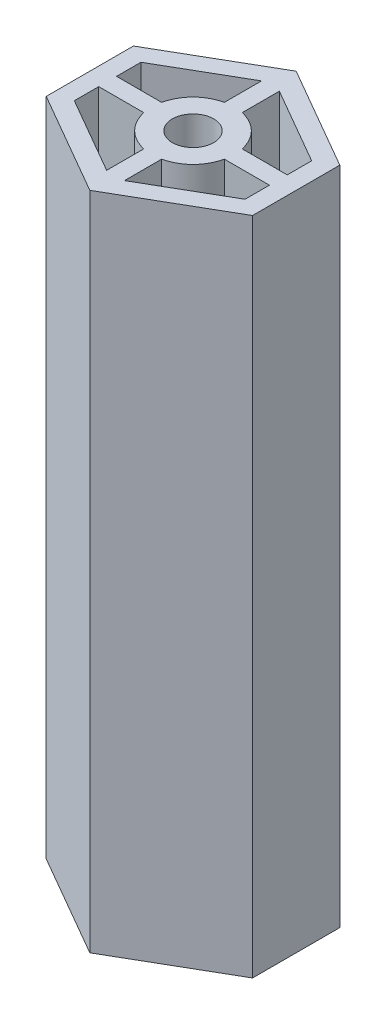
ISO-10303-21;
HEADER;
FILE_DESCRIPTION(('STEP AP214'),'2;1');
FILE_NAME('part.step','',(''),(''),'','','');
FILE_SCHEMA(('AUTOMOTIVE_DESIGN { 1 0 10303 214 1 1 1 1 }'));
ENDSEC;
DATA;
#1=APPLICATION_CONTEXT('core data for automotive mechanical design processes');
#2=APPLICATION_PROTOCOL_DEFINITION('international standard','automotive_design',2000,#1);
#3=PRODUCT_CONTEXT('',#1,'mechanical');
#4=PRODUCT('Part','Part','',(#3));
#5=PRODUCT_RELATED_PRODUCT_CATEGORY('part','',(#4));
#6=PRODUCT_DEFINITION_FORMATION('','',#4);
#7=PRODUCT_DEFINITION_CONTEXT('part definition',#1,'design');
#8=PRODUCT_DEFINITION('design','',#6,#7);
#9=PRODUCT_DEFINITION_SHAPE('','',#8);
#10=(LENGTH_UNIT() NAMED_UNIT(*) SI_UNIT(.MILLI.,.METRE.));
#11=(NAMED_UNIT(*) PLANE_ANGLE_UNIT() SI_UNIT($,.RADIAN.));
#12=(NAMED_UNIT(*) SI_UNIT($,.STERADIAN.) SOLID_ANGLE_UNIT());
#13=UNCERTAINTY_MEASURE_WITH_UNIT(LENGTH_MEASURE(1.E-05),#10,'distance_accuracy_value','');
#14=(GEOMETRIC_REPRESENTATION_CONTEXT(3) GLOBAL_UNCERTAINTY_ASSIGNED_CONTEXT((#13)) GLOBAL_UNIT_ASSIGNED_CONTEXT((#10,
#11,#12)) REPRESENTATION_CONTEXT('',''));
#15=CARTESIAN_POINT('',(0.,0.,0.));
#16=DIRECTION('',(0.,0.,1.));
#17=DIRECTION('',(1.,0.,0.));
#18=AXIS2_PLACEMENT_3D('',#15,#16,#17);
#19=CARTESIAN_POINT('',(0.,80.,0.));
#20=DIRECTION('',(0.,1.,0.));
#21=DIRECTION('',(0.,0.,1.));
#22=AXIS2_PLACEMENT_3D('',#19,#20,#21);
#23=PLANE('',#22);
#24=DIRECTION('',(0.,0.,-1.));
#25=VECTOR('',#24,1.);
#26=CARTESIAN_POINT('',(10.34,80.,1.08));
#27=LINE('',#26,#25);
#28=CARTESIAN_POINT('',(10.34,80.,4.03604505368013));
#29=VERTEX_POINT('',#28);
#30=CARTESIAN_POINT('',(10.34,80.,1.08));
#31=VERTEX_POINT('',#30);
#32=EDGE_CURVE('E218',#29,#31,#27,.T.);
#33=ORIENTED_EDGE('',*,*,#32,.F.);
#34=DIRECTION('',(0.866025403784439,0.,-0.5));
#35=VECTOR('',#34,1.);
#36=CARTESIAN_POINT('',(10.34,80.,4.03604505368013));
#37=LINE('',#36,#35);
#38=CARTESIAN_POINT('',(1.08,80.,9.38230854637606));
#39=VERTEX_POINT('',#38);
#40=EDGE_CURVE('E210',#39,#29,#37,.T.);
#41=ORIENTED_EDGE('',*,*,#40,.F.);
#42=DIRECTION('',(0.,0.,1.));
#43=VECTOR('',#42,1.);
#44=CARTESIAN_POINT('',(1.08,80.,4.88196681676555));
#45=LINE('',#44,#43);
#46=CARTESIAN_POINT('',(1.08,80.,4.88196681676555));
#47=VERTEX_POINT('',#46);
#48=EDGE_CURVE('E239',#47,#39,#45,.T.);
#49=ORIENTED_EDGE('',*,*,#48,.F.);
#50=CARTESIAN_POINT('',(0.,80.,0.));
#51=DIRECTION('',(0.,-1.,0.));
#52=DIRECTION('',(0.,0.,1.));
#53=AXIS2_PLACEMENT_3D('',#50,#51,#52);
#54=CIRCLE('',#53,5.);
#55=CARTESIAN_POINT('',(4.88196681676555,80.,1.08));
#56=VERTEX_POINT('',#55);
#57=EDGE_CURVE('E234',#56,#47,#54,.T.);
#58=ORIENTED_EDGE('',*,*,#57,.F.);
#59=DIRECTION('',(-1.,0.,0.));
#60=VECTOR('',#59,1.);
#61=CARTESIAN_POINT('',(4.88196681676556,80.,1.08));
#62=LINE('',#61,#60);
#63=EDGE_CURVE('E232',#31,#56,#62,.T.);
#64=ORIENTED_EDGE('',*,*,#63,.F.);
#65=EDGE_LOOP('',(#33,#41,#49,#58,#64));
#66=FACE_BOUND('',#65,.T.);
#67=DIRECTION('',(-1.,0.,0.));
#68=VECTOR('',#67,1.);
#69=CARTESIAN_POINT('',(-10.34,80.,1.08));
#70=LINE('',#69,#68);
#71=CARTESIAN_POINT('',(-4.88196681676555,80.,1.08));
#72=VERTEX_POINT('',#71);
#73=CARTESIAN_POINT('',(-10.34,80.,1.08));
#74=VERTEX_POINT('',#73);
#75=EDGE_CURVE('E259',#72,#74,#70,.T.);
#76=ORIENTED_EDGE('',*,*,#75,.F.);
#77=CARTESIAN_POINT('',(0.,80.,0.));
#78=DIRECTION('',(0.,-1.,0.));
#79=DIRECTION('',(0.,0.,1.));
#80=AXIS2_PLACEMENT_3D('',#77,#78,#79);
#81=CIRCLE('',#80,5.);
#82=CARTESIAN_POINT('',(-1.08,80.,4.88196681676555));
#83=VERTEX_POINT('',#82);
#84=EDGE_CURVE('E257',#83,#72,#81,.T.);
#85=ORIENTED_EDGE('',*,*,#84,.F.);
#86=DIRECTION('',(0.,0.,-1.));
#87=VECTOR('',#86,1.);
#88=CARTESIAN_POINT('',(-1.08,80.,4.88196681676555));
#89=LINE('',#88,#87);
#90=CARTESIAN_POINT('',(-1.08,80.,9.38230854637607));
#91=VERTEX_POINT('',#90);
#92=EDGE_CURVE('E267',#91,#83,#89,.T.);
#93=ORIENTED_EDGE('',*,*,#92,.F.);
#94=DIRECTION('',(0.866025403784439,0.,0.5));
#95=VECTOR('',#94,1.);
#96=CARTESIAN_POINT('',(-10.34,80.,4.03604505368013));
#97=LINE('',#96,#95);
#98=CARTESIAN_POINT('',(-10.34,80.,4.03604505368013));
#99=VERTEX_POINT('',#98);
#100=EDGE_CURVE('E264',#99,#91,#97,.T.);
#101=ORIENTED_EDGE('',*,*,#100,.F.);
#102=DIRECTION('',(0.,0.,1.));
#103=VECTOR('',#102,1.);
#104=CARTESIAN_POINT('',(-10.34,80.,1.08));
#105=LINE('',#104,#103);
#106=EDGE_CURVE('E262',#74,#99,#105,.T.);
#107=ORIENTED_EDGE('',*,*,#106,.F.);
#108=EDGE_LOOP('',(#76,#85,#93,#101,#107));
#109=FACE_BOUND('',#108,.T.);
#110=DIRECTION('',(0.,0.,-1.));
#111=VECTOR('',#110,1.);
#112=CARTESIAN_POINT('',(-1.08,80.,-9.38230854637594));
#113=LINE('',#112,#111);
#114=CARTESIAN_POINT('',(-1.08,80.,-4.88196681676555));
#115=VERTEX_POINT('',#114);
#116=CARTESIAN_POINT('',(-1.08,80.,-9.38230854637594));
#117=VERTEX_POINT('',#116);
#118=EDGE_CURVE('E297',#115,#117,#113,.T.);
#119=ORIENTED_EDGE('',*,*,#118,.F.);
#120=CARTESIAN_POINT('',(0.,80.,0.));
#121=DIRECTION('',(0.,-1.,0.));
#122=DIRECTION('',(0.,0.,1.));
#123=AXIS2_PLACEMENT_3D('',#120,#121,#122);
#124=CIRCLE('',#123,5.);
#125=CARTESIAN_POINT('',(-4.88196681676555,80.,-1.08));
#126=VERTEX_POINT('',#125);
#127=EDGE_CURVE('E295',#126,#115,#124,.T.);
#128=ORIENTED_EDGE('',*,*,#127,.F.);
#129=DIRECTION('',(1.,0.,0.));
#130=VECTOR('',#129,1.);
#131=CARTESIAN_POINT('',(-10.34,80.,-1.08));
#132=LINE('',#131,#130);
#133=CARTESIAN_POINT('',(-10.34,80.,-1.08));
#134=VERTEX_POINT('',#133);
#135=EDGE_CURVE('E305',#134,#126,#132,.T.);
#136=ORIENTED_EDGE('',*,*,#135,.F.);
#137=DIRECTION('',(0.,0.,1.));
#138=VECTOR('',#137,1.);
#139=CARTESIAN_POINT('',(-10.34,80.,-4.03604505368));
#140=LINE('',#139,#138);
#141=CARTESIAN_POINT('',(-10.34,80.,-4.03604505368));
#142=VERTEX_POINT('',#141);
#143=EDGE_CURVE('E302',#142,#134,#140,.T.);
#144=ORIENTED_EDGE('',*,*,#143,.F.);
#145=DIRECTION('',(-0.866025403784439,0.,0.5));
#146=VECTOR('',#145,1.);
#147=CARTESIAN_POINT('',(-10.34,80.,-4.03604505368));
#148=LINE('',#147,#146);
#149=EDGE_CURVE('E300',#117,#142,#148,.T.);
#150=ORIENTED_EDGE('',*,*,#149,.F.);
#151=EDGE_LOOP('',(#119,#128,#136,#144,#150));
#152=FACE_BOUND('',#151,.T.);
#153=DIRECTION('',(0.,0.,1.));
#154=VECTOR('',#153,1.);
#155=CARTESIAN_POINT('',(1.08,80.,-9.38230854637594));
#156=LINE('',#155,#154);
#157=CARTESIAN_POINT('',(1.08,80.,-9.38230854637594));
#158=VERTEX_POINT('',#157);
#159=CARTESIAN_POINT('',(1.08,80.,-4.88196681676555));
#160=VERTEX_POINT('',#159);
#161=EDGE_CURVE('E335',#158,#160,#156,.T.);
#162=ORIENTED_EDGE('',*,*,#161,.F.);
#163=DIRECTION('',(-0.866025403784439,0.,-0.5));
#164=VECTOR('',#163,1.);
#165=CARTESIAN_POINT('',(10.34,80.,-4.03604505368));
#166=LINE('',#165,#164);
#167=CARTESIAN_POINT('',(10.34,80.,-4.03604505368));
#168=VERTEX_POINT('',#167);
#169=EDGE_CURVE('E333',#168,#158,#166,.T.);
#170=ORIENTED_EDGE('',*,*,#169,.F.);
#171=DIRECTION('',(0.,0.,-1.));
#172=VECTOR('',#171,1.);
#173=CARTESIAN_POINT('',(10.34,80.,-4.03604505368));
#174=LINE('',#173,#172);
#175=CARTESIAN_POINT('',(10.34,80.,-1.08));
#176=VERTEX_POINT('',#175);
#177=EDGE_CURVE('E343',#176,#168,#174,.T.);
#178=ORIENTED_EDGE('',*,*,#177,.F.);
#179=DIRECTION('',(1.,0.,0.));
#180=VECTOR('',#179,1.);
#181=CARTESIAN_POINT('',(4.88196681676555,80.,-1.08));
#182=LINE('',#181,#180);
#183=CARTESIAN_POINT('',(4.88196681676555,80.,-1.08));
#184=VERTEX_POINT('',#183);
#185=EDGE_CURVE('E340',#184,#176,#182,.T.);
#186=ORIENTED_EDGE('',*,*,#185,.F.);
#187=CARTESIAN_POINT('',(0.,80.,0.));
#188=DIRECTION('',(0.,-1.,0.));
#189=DIRECTION('',(0.,0.,1.));
#190=AXIS2_PLACEMENT_3D('',#187,#188,#189);
#191=CIRCLE('',#190,5.);
#192=EDGE_CURVE('E338',#160,#184,#191,.T.);
#193=ORIENTED_EDGE('',*,*,#192,.F.);
#194=EDGE_LOOP('',(#162,#170,#178,#186,#193));
#195=FACE_BOUND('',#194,.T.);
#196=DIRECTION('',(-0.866025403784436,0.,0.500000000000004));
#197=VECTOR('',#196,1.);
#198=CARTESIAN_POINT('',(-12.5,80.,-5.28312163512959));
#199=LINE('',#198,#197);
#200=CARTESIAN_POINT('',(0.,80.,-12.5));
#201=VERTEX_POINT('',#200);
#202=CARTESIAN_POINT('',(-12.5,80.,-5.28312163512959));
#203=VERTEX_POINT('',#202);
#204=EDGE_CURVE('E371',#201,#203,#199,.T.);
#205=ORIENTED_EDGE('',*,*,#204,.T.);
#206=DIRECTION('',(0.,0.,1.));
#207=VECTOR('',#206,1.);
#208=CARTESIAN_POINT('',(-12.5,80.,-5.28312163512959));
#209=LINE('',#208,#207);
#210=CARTESIAN_POINT('',(-12.5,80.,5.28312163512973));
#211=VERTEX_POINT('',#210);
#212=EDGE_CURVE('E374',#203,#211,#209,.T.);
#213=ORIENTED_EDGE('',*,*,#212,.T.);
#214=DIRECTION('',(0.86602540378444,0.,0.499999999999998));
#215=VECTOR('',#214,1.);
#216=CARTESIAN_POINT('',(-12.5,80.,5.28312163512973));
#217=LINE('',#216,#215);
#218=CARTESIAN_POINT('',(0.,80.,12.5));
#219=VERTEX_POINT('',#218);
#220=EDGE_CURVE('E377',#211,#219,#217,.T.);
#221=ORIENTED_EDGE('',*,*,#220,.T.);
#222=DIRECTION('',(0.86602540378444,0.,-0.499999999999998));
#223=VECTOR('',#222,1.);
#224=CARTESIAN_POINT('',(12.5,80.,5.28312163512972));
#225=LINE('',#224,#223);
#226=CARTESIAN_POINT('',(12.5,80.,5.28312163512972));
#227=VERTEX_POINT('',#226);
#228=EDGE_CURVE('E379',#219,#227,#225,.T.);
#229=ORIENTED_EDGE('',*,*,#228,.T.);
#230=DIRECTION('',(0.,0.,-1.));
#231=VECTOR('',#230,1.);
#232=CARTESIAN_POINT('',(12.5,80.,-5.28312163512959));
#233=LINE('',#232,#231);
#234=CARTESIAN_POINT('',(12.5,80.,-5.28312163512959));
#235=VERTEX_POINT('',#234);
#236=EDGE_CURVE('E381',#227,#235,#233,.T.);
#237=ORIENTED_EDGE('',*,*,#236,.T.);
#238=DIRECTION('',(-0.866025403784436,0.,-0.500000000000004));
#239=VECTOR('',#238,1.);
#240=CARTESIAN_POINT('',(12.5,80.,-5.28312163512959));
#241=LINE('',#240,#239);
#242=EDGE_CURVE('E383',#235,#201,#241,.T.);
#243=ORIENTED_EDGE('',*,*,#242,.T.);
#244=EDGE_LOOP('',(#205,#213,#221,#229,#237,#243));
#245=FACE_BOUND('',#244,.T.);
#246=CARTESIAN_POINT('',(0.,80.,0.));
#247=DIRECTION('',(0.,1.,0.));
#248=DIRECTION('',(0.,0.,1.));
#249=AXIS2_PLACEMENT_3D('',#246,#247,#248);
#250=CIRCLE('',#249,2.5);
#251=CARTESIAN_POINT('',(0.,80.,2.5));
#252=VERTEX_POINT('',#251);
#253=EDGE_CURVE('E242',#252,#252,#250,.T.);
#254=ORIENTED_EDGE('',*,*,#253,.F.);
#255=EDGE_LOOP('',(#254));
#256=FACE_BOUND('',#255,.T.);
#257=ADVANCED_FACE('F37',(#66,#109,#152,#195,#245,#256),#23,.T.);
#258=CARTESIAN_POINT('',(0.,0.,0.));
#259=DIRECTION('',(0.,1.,0.));
#260=DIRECTION('',(0.,0.,1.));
#261=AXIS2_PLACEMENT_3D('',#258,#259,#260);
#262=PLANE('',#261);
#263=CARTESIAN_POINT('',(0.,0.,0.));
#264=DIRECTION('',(0.,-1.,0.));
#265=DIRECTION('',(0.,0.,1.));
#266=AXIS2_PLACEMENT_3D('',#263,#264,#265);
#267=CIRCLE('',#266,5.);
#268=CARTESIAN_POINT('',(-1.08,0.,4.88196681676555));
#269=VERTEX_POINT('',#268);
#270=CARTESIAN_POINT('',(-4.88196681676555,0.,1.08));
#271=VERTEX_POINT('',#270);
#272=EDGE_CURVE('E226',#269,#271,#267,.T.);
#273=ORIENTED_EDGE('',*,*,#272,.T.);
#274=DIRECTION('',(-1.,0.,0.));
#275=VECTOR('',#274,1.);
#276=CARTESIAN_POINT('',(-10.34,0.,1.08));
#277=LINE('',#276,#275);
#278=CARTESIAN_POINT('',(-10.34,0.,1.08));
#279=VERTEX_POINT('',#278);
#280=EDGE_CURVE('E272',#271,#279,#277,.T.);
#281=ORIENTED_EDGE('',*,*,#280,.T.);
#282=DIRECTION('',(0.,0.,1.));
#283=VECTOR('',#282,1.);
#284=CARTESIAN_POINT('',(-10.34,0.,1.08));
#285=LINE('',#284,#283);
#286=CARTESIAN_POINT('',(-10.34,0.,4.03604505368013));
#287=VERTEX_POINT('',#286);
#288=EDGE_CURVE('E275',#279,#287,#285,.T.);
#289=ORIENTED_EDGE('',*,*,#288,.T.);
#290=DIRECTION('',(0.866025403784439,0.,0.5));
#291=VECTOR('',#290,1.);
#292=CARTESIAN_POINT('',(-10.34,0.,4.03604505368013));
#293=LINE('',#292,#291);
#294=CARTESIAN_POINT('',(-1.08,0.,9.38230854637607));
#295=VERTEX_POINT('',#294);
#296=EDGE_CURVE('E278',#287,#295,#293,.T.);
#297=ORIENTED_EDGE('',*,*,#296,.T.);
#298=DIRECTION('',(0.,0.,-1.));
#299=VECTOR('',#298,1.);
#300=CARTESIAN_POINT('',(-1.08,0.,4.88196681676555));
#301=LINE('',#300,#299);
#302=EDGE_CURVE('E260',#295,#269,#301,.T.);
#303=ORIENTED_EDGE('',*,*,#302,.T.);
#304=EDGE_LOOP('',(#273,#281,#289,#297,#303));
#305=FACE_BOUND('',#304,.T.);
#306=DIRECTION('',(-0.866025403784439,0.,-0.5));
#307=VECTOR('',#306,1.);
#308=CARTESIAN_POINT('',(10.34,0.,-4.03604505368));
#309=LINE('',#308,#307);
#310=CARTESIAN_POINT('',(10.34,0.,-4.03604505368));
#311=VERTEX_POINT('',#310);
#312=CARTESIAN_POINT('',(1.08,0.,-9.38230854637594));
#313=VERTEX_POINT('',#312);
#314=EDGE_CURVE('E332',#311,#313,#309,.T.);
#315=ORIENTED_EDGE('',*,*,#314,.T.);
#316=DIRECTION('',(0.,0.,1.));
#317=VECTOR('',#316,1.);
#318=CARTESIAN_POINT('',(1.08,0.,-9.38230854637594));
#319=LINE('',#318,#317);
#320=CARTESIAN_POINT('',(1.08,0.,-4.88196681676555));
#321=VERTEX_POINT('',#320);
#322=EDGE_CURVE('E348',#313,#321,#319,.T.);
#323=ORIENTED_EDGE('',*,*,#322,.T.);
#324=CARTESIAN_POINT('',(0.,0.,0.));
#325=DIRECTION('',(0.,-1.,0.));
#326=DIRECTION('',(0.,0.,1.));
#327=AXIS2_PLACEMENT_3D('',#324,#325,#326);
#328=CIRCLE('',#327,5.);
#329=CARTESIAN_POINT('',(4.88196681676555,0.,-1.08));
#330=VERTEX_POINT('',#329);
#331=EDGE_CURVE('E351',#321,#330,#328,.T.);
#332=ORIENTED_EDGE('',*,*,#331,.T.);
#333=DIRECTION('',(1.,0.,0.));
#334=VECTOR('',#333,1.);
#335=CARTESIAN_POINT('',(4.88196681676555,0.,-1.08));
#336=LINE('',#335,#334);
#337=CARTESIAN_POINT('',(10.34,0.,-1.08));
#338=VERTEX_POINT('',#337);
#339=EDGE_CURVE('E354',#330,#338,#336,.T.);
#340=ORIENTED_EDGE('',*,*,#339,.T.);
#341=DIRECTION('',(0.,0.,-1.));
#342=VECTOR('',#341,1.);
#343=CARTESIAN_POINT('',(10.34,0.,-4.03604505368));
#344=LINE('',#343,#342);
#345=EDGE_CURVE('E336',#338,#311,#344,.T.);
#346=ORIENTED_EDGE('',*,*,#345,.T.);
#347=EDGE_LOOP('',(#315,#323,#332,#340,#346));
#348=FACE_BOUND('',#347,.T.);
#349=DIRECTION('',(-0.866025403784436,0.,0.500000000000004));
#350=VECTOR('',#349,1.);
#351=CARTESIAN_POINT('',(-12.5,0.,-5.28312163512959));
#352=LINE('',#351,#350);
#353=CARTESIAN_POINT('',(0.,0.,-12.5));
#354=VERTEX_POINT('',#353);
#355=CARTESIAN_POINT('',(-12.5,0.,-5.28312163512959));
#356=VERTEX_POINT('',#355);
#357=EDGE_CURVE('E370',#354,#356,#352,.T.);
#358=ORIENTED_EDGE('',*,*,#357,.F.);
#359=DIRECTION('',(-0.866025403784436,0.,-0.500000000000004));
#360=VECTOR('',#359,1.);
#361=CARTESIAN_POINT('',(12.5,0.,-5.28312163512959));
#362=LINE('',#361,#360);
#363=CARTESIAN_POINT('',(12.5,0.,-5.28312163512959));
#364=VERTEX_POINT('',#363);
#365=EDGE_CURVE('E375',#364,#354,#362,.T.);
#366=ORIENTED_EDGE('',*,*,#365,.F.);
#367=DIRECTION('',(0.,0.,-1.));
#368=VECTOR('',#367,1.);
#369=CARTESIAN_POINT('',(12.5,0.,-5.28312163512959));
#370=LINE('',#369,#368);
#371=CARTESIAN_POINT('',(12.5,0.,5.28312163512972));
#372=VERTEX_POINT('',#371);
#373=EDGE_CURVE('E394',#372,#364,#370,.T.);
#374=ORIENTED_EDGE('',*,*,#373,.F.);
#375=DIRECTION('',(0.86602540378444,0.,-0.499999999999998));
#376=VECTOR('',#375,1.);
#377=CARTESIAN_POINT('',(12.5,0.,5.28312163512972));
#378=LINE('',#377,#376);
#379=CARTESIAN_POINT('',(0.,0.,12.5));
#380=VERTEX_POINT('',#379);
#381=EDGE_CURVE('E392',#380,#372,#378,.T.);
#382=ORIENTED_EDGE('',*,*,#381,.F.);
#383=DIRECTION('',(0.86602540378444,0.,0.499999999999998));
#384=VECTOR('',#383,1.);
#385=CARTESIAN_POINT('',(-12.5,0.,5.28312163512973));
#386=LINE('',#385,#384);
#387=CARTESIAN_POINT('',(-12.5,0.,5.28312163512973));
#388=VERTEX_POINT('',#387);
#389=EDGE_CURVE('E390',#388,#380,#386,.T.);
#390=ORIENTED_EDGE('',*,*,#389,.F.);
#391=DIRECTION('',(0.,0.,1.));
#392=VECTOR('',#391,1.);
#393=CARTESIAN_POINT('',(-12.5,0.,-5.28312163512959));
#394=LINE('',#393,#392);
#395=EDGE_CURVE('E388',#356,#388,#394,.T.);
#396=ORIENTED_EDGE('',*,*,#395,.F.);
#397=EDGE_LOOP('',(#358,#366,#374,#382,#390,#396));
#398=FACE_BOUND('',#397,.T.);
#399=CARTESIAN_POINT('',(0.,0.,0.));
#400=DIRECTION('',(0.,-1.,0.));
#401=DIRECTION('',(0.,0.,1.));
#402=AXIS2_PLACEMENT_3D('',#399,#400,#401);
#403=CIRCLE('',#402,5.);
#404=CARTESIAN_POINT('',(-4.88196681676555,0.,-1.08));
#405=VERTEX_POINT('',#404);
#406=CARTESIAN_POINT('',(-1.08,0.,-4.88196681676555));
#407=VERTEX_POINT('',#406);
#408=EDGE_CURVE('E294',#405,#407,#403,.T.);
#409=ORIENTED_EDGE('',*,*,#408,.T.);
#410=DIRECTION('',(0.,0.,-1.));
#411=VECTOR('',#410,1.);
#412=CARTESIAN_POINT('',(-1.08,0.,-9.38230854637594));
#413=LINE('',#412,#411);
#414=CARTESIAN_POINT('',(-1.08,0.,-9.38230854637594));
#415=VERTEX_POINT('',#414);
#416=EDGE_CURVE('E310',#407,#415,#413,.T.);
#417=ORIENTED_EDGE('',*,*,#416,.T.);
#418=DIRECTION('',(-0.866025403784439,0.,0.5));
#419=VECTOR('',#418,1.);
#420=CARTESIAN_POINT('',(-10.34,0.,-4.03604505368));
#421=LINE('',#420,#419);
#422=CARTESIAN_POINT('',(-10.34,0.,-4.03604505368));
#423=VERTEX_POINT('',#422);
#424=EDGE_CURVE('E313',#415,#423,#421,.T.);
#425=ORIENTED_EDGE('',*,*,#424,.T.);
#426=DIRECTION('',(0.,0.,1.));
#427=VECTOR('',#426,1.);
#428=CARTESIAN_POINT('',(-10.34,0.,-4.03604505368));
#429=LINE('',#428,#427);
#430=CARTESIAN_POINT('',(-10.34,0.,-1.08));
#431=VERTEX_POINT('',#430);
#432=EDGE_CURVE('E316',#423,#431,#429,.T.);
#433=ORIENTED_EDGE('',*,*,#432,.T.);
#434=DIRECTION('',(1.,0.,0.));
#435=VECTOR('',#434,1.);
#436=CARTESIAN_POINT('',(-10.34,0.,-1.08));
#437=LINE('',#436,#435);
#438=EDGE_CURVE('E298',#431,#405,#437,.T.);
#439=ORIENTED_EDGE('',*,*,#438,.T.);
#440=EDGE_LOOP('',(#409,#417,#425,#433,#439));
#441=FACE_BOUND('',#440,.T.);
#442=DIRECTION('',(0.866025403784439,0.,-0.5));
#443=VECTOR('',#442,1.);
#444=CARTESIAN_POINT('',(10.34,0.,4.03604505368013));
#445=LINE('',#444,#443);
#446=CARTESIAN_POINT('',(1.08,0.,9.38230854637606));
#447=VERTEX_POINT('',#446);
#448=CARTESIAN_POINT('',(10.34,0.,4.03604505368013));
#449=VERTEX_POINT('',#448);
#450=EDGE_CURVE('E60',#447,#449,#445,.T.);
#451=ORIENTED_EDGE('',*,*,#450,.T.);
#452=DIRECTION('',(0.,0.,-1.));
#453=VECTOR('',#452,1.);
#454=CARTESIAN_POINT('',(10.34,0.,1.08));
#455=LINE('',#454,#453);
#456=CARTESIAN_POINT('',(10.34,0.,1.08));
#457=VERTEX_POINT('',#456);
#458=EDGE_CURVE('E225',#449,#457,#455,.T.);
#459=ORIENTED_EDGE('',*,*,#458,.T.);
#460=DIRECTION('',(-1.,0.,0.));
#461=VECTOR('',#460,1.);
#462=CARTESIAN_POINT('',(4.88196681676556,0.,1.08));
#463=LINE('',#462,#461);
#464=CARTESIAN_POINT('',(4.88196681676555,0.,1.08));
#465=VERTEX_POINT('',#464);
#466=EDGE_CURVE('E244',#457,#465,#463,.T.);
#467=ORIENTED_EDGE('',*,*,#466,.T.);
#468=CARTESIAN_POINT('',(0.,0.,0.));
#469=DIRECTION('',(0.,-1.,0.));
#470=DIRECTION('',(0.,0.,1.));
#471=AXIS2_PLACEMENT_3D('',#468,#469,#470);
#472=CIRCLE('',#471,5.);
#473=CARTESIAN_POINT('',(1.08,0.,4.88196681676555));
#474=VERTEX_POINT('',#473);
#475=EDGE_CURVE('E247',#465,#474,#472,.T.);
#476=ORIENTED_EDGE('',*,*,#475,.T.);
#477=DIRECTION('',(0.,0.,1.));
#478=VECTOR('',#477,1.);
#479=CARTESIAN_POINT('',(1.08,0.,4.88196681676555));
#480=LINE('',#479,#478);
#481=EDGE_CURVE('E219',#474,#447,#480,.T.);
#482=ORIENTED_EDGE('',*,*,#481,.T.);
#483=EDGE_LOOP('',(#451,#459,#467,#476,#482));
#484=FACE_BOUND('',#483,.T.);
#485=CARTESIAN_POINT('',(0.,0.,0.));
#486=DIRECTION('',(0.,1.,0.));
#487=DIRECTION('',(0.,0.,1.));
#488=AXIS2_PLACEMENT_3D('',#485,#486,#487);
#489=CIRCLE('',#488,2.5);
#490=CARTESIAN_POINT('',(0.,0.,2.5));
#491=VERTEX_POINT('',#490);
#492=EDGE_CURVE('E539',#491,#491,#489,.T.);
#493=ORIENTED_EDGE('',*,*,#492,.T.);
#494=EDGE_LOOP('',(#493));
#495=FACE_BOUND('',#494,.T.);
#496=ADVANCED_FACE('F418',(#305,#348,#398,#441,#484,#495),#262,.F.);
#497=CARTESIAN_POINT('',(-12.5,80.,-5.28312163512959));
#498=DIRECTION('',(0.500000000000004,0.,0.866025403784436));
#499=DIRECTION('',(0.866025403784436,0.,-0.500000000000004));
#500=AXIS2_PLACEMENT_3D('',#497,#498,#499);
#501=PLANE('',#500);
#502=ORIENTED_EDGE('',*,*,#357,.T.);
#503=DIRECTION('',(0.,-1.,0.));
#504=VECTOR('',#503,1.);
#505=CARTESIAN_POINT('',(-12.5,80.,-5.28312163512959));
#506=LINE('',#505,#504);
#507=EDGE_CURVE('E11',#203,#356,#506,.T.);
#508=ORIENTED_EDGE('',*,*,#507,.F.);
#509=ORIENTED_EDGE('',*,*,#204,.F.);
#510=DIRECTION('',(0.,-1.,0.));
#511=VECTOR('',#510,1.);
#512=CARTESIAN_POINT('',(0.,80.,-12.5));
#513=LINE('',#512,#511);
#514=EDGE_CURVE('E385',#201,#354,#513,.T.);
#515=ORIENTED_EDGE('',*,*,#514,.T.);
#516=EDGE_LOOP('',(#502,#508,#509,#515));
#517=FACE_BOUND('',#516,.T.);
#518=ADVANCED_FACE('F39',(#517),#501,.F.);
#519=CARTESIAN_POINT('',(-12.5,80.,-5.28312163512959));
#520=DIRECTION('',(1.,0.,0.));
#521=DIRECTION('',(0.,0.,-1.));
#522=AXIS2_PLACEMENT_3D('',#519,#520,#521);
#523=PLANE('',#522);
#524=ORIENTED_EDGE('',*,*,#395,.T.);
#525=DIRECTION('',(0.,-1.,0.));
#526=VECTOR('',#525,1.);
#527=CARTESIAN_POINT('',(-12.5,80.,5.28312163512973));
#528=LINE('',#527,#526);
#529=EDGE_CURVE('E45',#211,#388,#528,.T.);
#530=ORIENTED_EDGE('',*,*,#529,.F.);
#531=ORIENTED_EDGE('',*,*,#212,.F.);
#532=ORIENTED_EDGE('',*,*,#507,.T.);
#533=EDGE_LOOP('',(#524,#530,#531,#532));
#534=FACE_BOUND('',#533,.T.);
#535=ADVANCED_FACE('F436',(#534),#523,.F.);
#536=CARTESIAN_POINT('',(-12.5,80.,5.28312163512973));
#537=DIRECTION('',(0.499999999999998,0.,-0.86602540378444));
#538=DIRECTION('',(-0.86602540378444,0.,-0.499999999999998));
#539=AXIS2_PLACEMENT_3D('',#536,#537,#538);
#540=PLANE('',#539);
#541=ORIENTED_EDGE('',*,*,#389,.T.);
#542=DIRECTION('',(0.,-1.,0.));
#543=VECTOR('',#542,1.);
#544=CARTESIAN_POINT('',(0.,80.,12.5));
#545=LINE('',#544,#543);
#546=EDGE_CURVE('E405',#219,#380,#545,.T.);
#547=ORIENTED_EDGE('',*,*,#546,.F.);
#548=ORIENTED_EDGE('',*,*,#220,.F.);
#549=ORIENTED_EDGE('',*,*,#529,.T.);
#550=EDGE_LOOP('',(#541,#547,#548,#549));
#551=FACE_BOUND('',#550,.T.);
#552=ADVANCED_FACE('F412',(#551),#540,.F.);
#553=CARTESIAN_POINT('',(12.5,80.,5.28312163512972));
#554=DIRECTION('',(-0.499999999999998,0.,-0.86602540378444));
#555=DIRECTION('',(-0.86602540378444,0.,0.499999999999998));
#556=AXIS2_PLACEMENT_3D('',#553,#554,#555);
#557=PLANE('',#556);
#558=ORIENTED_EDGE('',*,*,#381,.T.);
#559=DIRECTION('',(0.,-1.,0.));
#560=VECTOR('',#559,1.);
#561=CARTESIAN_POINT('',(12.5,80.,5.28312163512972));
#562=LINE('',#561,#560);
#563=EDGE_CURVE('E402',#227,#372,#562,.T.);
#564=ORIENTED_EDGE('',*,*,#563,.F.);
#565=ORIENTED_EDGE('',*,*,#228,.F.);
#566=ORIENTED_EDGE('',*,*,#546,.T.);
#567=EDGE_LOOP('',(#558,#564,#565,#566));
#568=FACE_BOUND('',#567,.T.);
#569=ADVANCED_FACE('F424',(#568),#557,.F.);
#570=CARTESIAN_POINT('',(12.5,80.,-5.28312163512959));
#571=DIRECTION('',(-1.,0.,0.));
#572=DIRECTION('',(0.,0.,1.));
#573=AXIS2_PLACEMENT_3D('',#570,#571,#572);
#574=PLANE('',#573);
#575=ORIENTED_EDGE('',*,*,#373,.T.);
#576=DIRECTION('',(0.,-1.,0.));
#577=VECTOR('',#576,1.);
#578=CARTESIAN_POINT('',(12.5,80.,-5.28312163512959));
#579=LINE('',#578,#577);
#580=EDGE_CURVE('E399',#235,#364,#579,.T.);
#581=ORIENTED_EDGE('',*,*,#580,.F.);
#582=ORIENTED_EDGE('',*,*,#236,.F.);
#583=ORIENTED_EDGE('',*,*,#563,.T.);
#584=EDGE_LOOP('',(#575,#581,#582,#583));
#585=FACE_BOUND('',#584,.T.);
#586=ADVANCED_FACE('F428',(#585),#574,.F.);
#587=CARTESIAN_POINT('',(12.5,80.,-5.28312163512959));
#588=DIRECTION('',(-0.500000000000004,0.,0.866025403784436));
#589=DIRECTION('',(0.866025403784436,0.,0.500000000000004));
#590=AXIS2_PLACEMENT_3D('',#587,#588,#589);
#591=PLANE('',#590);
#592=ORIENTED_EDGE('',*,*,#365,.T.);
#593=ORIENTED_EDGE('',*,*,#514,.F.);
#594=ORIENTED_EDGE('',*,*,#242,.F.);
#595=ORIENTED_EDGE('',*,*,#580,.T.);
#596=EDGE_LOOP('',(#592,#593,#594,#595));
#597=FACE_BOUND('',#596,.T.);
#598=ADVANCED_FACE('F439',(#597),#591,.F.);
#599=CARTESIAN_POINT('',(10.34,80.,-4.03604505368));
#600=DIRECTION('',(-0.5,0.,0.866025403784439));
#601=DIRECTION('',(0.866025403784439,0.,0.5));
#602=AXIS2_PLACEMENT_3D('',#599,#600,#601);
#603=PLANE('',#602);
#604=ORIENTED_EDGE('',*,*,#314,.F.);
#605=DIRECTION('',(0.,-1.,0.));
#606=VECTOR('',#605,1.);
#607=CARTESIAN_POINT('',(10.34,80.,-4.03604505368));
#608=LINE('',#607,#606);
#609=EDGE_CURVE('E345',#168,#311,#608,.T.);
#610=ORIENTED_EDGE('',*,*,#609,.F.);
#611=ORIENTED_EDGE('',*,*,#169,.T.);
#612=DIRECTION('',(0.,-1.,0.));
#613=VECTOR('',#612,1.);
#614=CARTESIAN_POINT('',(1.08,80.,-9.38230854637594));
#615=LINE('',#614,#613);
#616=EDGE_CURVE('E367',#158,#313,#615,.T.);
#617=ORIENTED_EDGE('',*,*,#616,.T.);
#618=EDGE_LOOP('',(#604,#610,#611,#617));
#619=FACE_BOUND('',#618,.T.);
#620=ADVANCED_FACE('F441',(#619),#603,.T.);
#621=CARTESIAN_POINT('',(1.08,80.,-9.38230854637594));
#622=DIRECTION('',(1.,0.,0.));
#623=DIRECTION('',(0.,0.,-1.));
#624=AXIS2_PLACEMENT_3D('',#621,#622,#623);
#625=PLANE('',#624);
#626=ORIENTED_EDGE('',*,*,#322,.F.);
#627=ORIENTED_EDGE('',*,*,#616,.F.);
#628=ORIENTED_EDGE('',*,*,#161,.T.);
#629=DIRECTION('',(0.,-1.,0.));
#630=VECTOR('',#629,1.);
#631=CARTESIAN_POINT('',(1.08,80.,-4.88196681676555));
#632=LINE('',#631,#630);
#633=EDGE_CURVE('E365',#160,#321,#632,.T.);
#634=ORIENTED_EDGE('',*,*,#633,.T.);
#635=EDGE_LOOP('',(#626,#627,#628,#634));
#636=FACE_BOUND('',#635,.T.);
#637=ADVANCED_FACE('F447',(#636),#625,.T.);
#638=CARTESIAN_POINT('',(0.,80.,0.));
#639=DIRECTION('',(0.,-1.,0.));
#640=DIRECTION('',(0.,0.,-1.));
#641=AXIS2_PLACEMENT_3D('',#638,#639,#640);
#642=CYLINDRICAL_SURFACE('',#641,5.);
#643=ORIENTED_EDGE('',*,*,#331,.F.);
#644=ORIENTED_EDGE('',*,*,#633,.F.);
#645=ORIENTED_EDGE('',*,*,#192,.T.);
#646=DIRECTION('',(0.,-1.,0.));
#647=VECTOR('',#646,1.);
#648=CARTESIAN_POINT('',(4.88196681676555,80.,-1.08));
#649=LINE('',#648,#647);
#650=EDGE_CURVE('E363',#184,#330,#649,.T.);
#651=ORIENTED_EDGE('',*,*,#650,.T.);
#652=EDGE_LOOP('',(#643,#644,#645,#651));
#653=FACE_BOUND('',#652,.T.);
#654=ADVANCED_FACE('F461',(#653),#642,.T.);
#655=CARTESIAN_POINT('',(4.88196681676555,80.,-1.08));
#656=DIRECTION('',(0.,0.,-1.));
#657=DIRECTION('',(-1.,0.,0.));
#658=AXIS2_PLACEMENT_3D('',#655,#656,#657);
#659=PLANE('',#658);
#660=ORIENTED_EDGE('',*,*,#339,.F.);
#661=ORIENTED_EDGE('',*,*,#650,.F.);
#662=ORIENTED_EDGE('',*,*,#185,.T.);
#663=DIRECTION('',(0.,-1.,0.));
#664=VECTOR('',#663,1.);
#665=CARTESIAN_POINT('',(10.34,80.,-1.08));
#666=LINE('',#665,#664);
#667=EDGE_CURVE('E361',#176,#338,#666,.T.);
#668=ORIENTED_EDGE('',*,*,#667,.T.);
#669=EDGE_LOOP('',(#660,#661,#662,#668));
#670=FACE_BOUND('',#669,.T.);
#671=ADVANCED_FACE('F465',(#670),#659,.T.);
#672=CARTESIAN_POINT('',(10.34,80.,-4.03604505368));
#673=DIRECTION('',(-1.,0.,0.));
#674=DIRECTION('',(0.,0.,1.));
#675=AXIS2_PLACEMENT_3D('',#672,#673,#674);
#676=PLANE('',#675);
#677=ORIENTED_EDGE('',*,*,#345,.F.);
#678=ORIENTED_EDGE('',*,*,#667,.F.);
#679=ORIENTED_EDGE('',*,*,#177,.T.);
#680=ORIENTED_EDGE('',*,*,#609,.T.);
#681=EDGE_LOOP('',(#677,#678,#679,#680));
#682=FACE_BOUND('',#681,.T.);
#683=ADVANCED_FACE('F469',(#682),#676,.T.);
#684=CARTESIAN_POINT('',(0.,80.,0.));
#685=DIRECTION('',(0.,-1.,0.));
#686=DIRECTION('',(0.,0.,-1.));
#687=AXIS2_PLACEMENT_3D('',#684,#685,#686);
#688=CYLINDRICAL_SURFACE('',#687,5.);
#689=ORIENTED_EDGE('',*,*,#408,.F.);
#690=DIRECTION('',(0.,-1.,0.));
#691=VECTOR('',#690,1.);
#692=CARTESIAN_POINT('',(-4.88196681676555,80.,-1.08));
#693=LINE('',#692,#691);
#694=EDGE_CURVE('E307',#126,#405,#693,.T.);
#695=ORIENTED_EDGE('',*,*,#694,.F.);
#696=ORIENTED_EDGE('',*,*,#127,.T.);
#697=DIRECTION('',(0.,-1.,0.));
#698=VECTOR('',#697,1.);
#699=CARTESIAN_POINT('',(-1.08,80.,-4.88196681676555));
#700=LINE('',#699,#698);
#701=EDGE_CURVE('E329',#115,#407,#700,.T.);
#702=ORIENTED_EDGE('',*,*,#701,.T.);
#703=EDGE_LOOP('',(#689,#695,#696,#702));
#704=FACE_BOUND('',#703,.T.);
#705=ADVANCED_FACE('F473',(#704),#688,.T.);
#706=CARTESIAN_POINT('',(-1.08,80.,-9.38230854637594));
#707=DIRECTION('',(-1.,0.,0.));
#708=DIRECTION('',(0.,0.,1.));
#709=AXIS2_PLACEMENT_3D('',#706,#707,#708);
#710=PLANE('',#709);
#711=ORIENTED_EDGE('',*,*,#416,.F.);
#712=ORIENTED_EDGE('',*,*,#701,.F.);
#713=ORIENTED_EDGE('',*,*,#118,.T.);
#714=DIRECTION('',(0.,-1.,0.));
#715=VECTOR('',#714,1.);
#716=CARTESIAN_POINT('',(-1.08,80.,-9.38230854637594));
#717=LINE('',#716,#715);
#718=EDGE_CURVE('E327',#117,#415,#717,.T.);
#719=ORIENTED_EDGE('',*,*,#718,.T.);
#720=EDGE_LOOP('',(#711,#712,#713,#719));
#721=FACE_BOUND('',#720,.T.);
#722=ADVANCED_FACE('F477',(#721),#710,.T.);
#723=CARTESIAN_POINT('',(-10.34,80.,-4.03604505368));
#724=DIRECTION('',(0.5,0.,0.866025403784439));
#725=DIRECTION('',(0.866025403784439,0.,-0.5));
#726=AXIS2_PLACEMENT_3D('',#723,#724,#725);
#727=PLANE('',#726);
#728=ORIENTED_EDGE('',*,*,#424,.F.);
#729=ORIENTED_EDGE('',*,*,#718,.F.);
#730=ORIENTED_EDGE('',*,*,#149,.T.);
#731=DIRECTION('',(0.,-1.,0.));
#732=VECTOR('',#731,1.);
#733=CARTESIAN_POINT('',(-10.34,80.,-4.03604505368));
#734=LINE('',#733,#732);
#735=EDGE_CURVE('E325',#142,#423,#734,.T.);
#736=ORIENTED_EDGE('',*,*,#735,.T.);
#737=EDGE_LOOP('',(#728,#729,#730,#736));
#738=FACE_BOUND('',#737,.T.);
#739=ADVANCED_FACE('F481',(#738),#727,.T.);
#740=CARTESIAN_POINT('',(-10.34,80.,-4.03604505368));
#741=DIRECTION('',(1.,0.,0.));
#742=DIRECTION('',(0.,0.,-1.));
#743=AXIS2_PLACEMENT_3D('',#740,#741,#742);
#744=PLANE('',#743);
#745=ORIENTED_EDGE('',*,*,#432,.F.);
#746=ORIENTED_EDGE('',*,*,#735,.F.);
#747=ORIENTED_EDGE('',*,*,#143,.T.);
#748=DIRECTION('',(0.,-1.,0.));
#749=VECTOR('',#748,1.);
#750=CARTESIAN_POINT('',(-10.34,80.,-1.08));
#751=LINE('',#750,#749);
#752=EDGE_CURVE('E323',#134,#431,#751,.T.);
#753=ORIENTED_EDGE('',*,*,#752,.T.);
#754=EDGE_LOOP('',(#745,#746,#747,#753));
#755=FACE_BOUND('',#754,.T.);
#756=ADVANCED_FACE('F485',(#755),#744,.T.);
#757=CARTESIAN_POINT('',(-10.34,80.,-1.08));
#758=DIRECTION('',(0.,0.,-1.));
#759=DIRECTION('',(-1.,0.,0.));
#760=AXIS2_PLACEMENT_3D('',#757,#758,#759);
#761=PLANE('',#760);
#762=ORIENTED_EDGE('',*,*,#438,.F.);
#763=ORIENTED_EDGE('',*,*,#752,.F.);
#764=ORIENTED_EDGE('',*,*,#135,.T.);
#765=ORIENTED_EDGE('',*,*,#694,.T.);
#766=EDGE_LOOP('',(#762,#763,#764,#765));
#767=FACE_BOUND('',#766,.T.);
#768=ADVANCED_FACE('F489',(#767),#761,.T.);
#769=CARTESIAN_POINT('',(0.,80.,0.));
#770=DIRECTION('',(0.,-1.,0.));
#771=DIRECTION('',(0.,0.,-1.));
#772=AXIS2_PLACEMENT_3D('',#769,#770,#771);
#773=CYLINDRICAL_SURFACE('',#772,5.);
#774=ORIENTED_EDGE('',*,*,#272,.F.);
#775=DIRECTION('',(0.,-1.,0.));
#776=VECTOR('',#775,1.);
#777=CARTESIAN_POINT('',(-1.08,80.,4.88196681676555));
#778=LINE('',#777,#776);
#779=EDGE_CURVE('E269',#83,#269,#778,.T.);
#780=ORIENTED_EDGE('',*,*,#779,.F.);
#781=ORIENTED_EDGE('',*,*,#84,.T.);
#782=DIRECTION('',(0.,-1.,0.));
#783=VECTOR('',#782,1.);
#784=CARTESIAN_POINT('',(-4.88196681676555,80.,1.08));
#785=LINE('',#784,#783);
#786=EDGE_CURVE('E291',#72,#271,#785,.T.);
#787=ORIENTED_EDGE('',*,*,#786,.T.);
#788=EDGE_LOOP('',(#774,#780,#781,#787));
#789=FACE_BOUND('',#788,.T.);
#790=ADVANCED_FACE('F493',(#789),#773,.T.);
#791=CARTESIAN_POINT('',(-10.34,80.,1.08));
#792=DIRECTION('',(0.,0.,1.));
#793=DIRECTION('',(1.,0.,0.));
#794=AXIS2_PLACEMENT_3D('',#791,#792,#793);
#795=PLANE('',#794);
#796=ORIENTED_EDGE('',*,*,#280,.F.);
#797=ORIENTED_EDGE('',*,*,#786,.F.);
#798=ORIENTED_EDGE('',*,*,#75,.T.);
#799=DIRECTION('',(0.,-1.,0.));
#800=VECTOR('',#799,1.);
#801=CARTESIAN_POINT('',(-10.34,80.,1.08));
#802=LINE('',#801,#800);
#803=EDGE_CURVE('E289',#74,#279,#802,.T.);
#804=ORIENTED_EDGE('',*,*,#803,.T.);
#805=EDGE_LOOP('',(#796,#797,#798,#804));
#806=FACE_BOUND('',#805,.T.);
#807=ADVANCED_FACE('F497',(#806),#795,.T.);
#808=CARTESIAN_POINT('',(-10.34,80.,1.08));
#809=DIRECTION('',(1.,0.,0.));
#810=DIRECTION('',(0.,0.,-1.));
#811=AXIS2_PLACEMENT_3D('',#808,#809,#810);
#812=PLANE('',#811);
#813=ORIENTED_EDGE('',*,*,#288,.F.);
#814=ORIENTED_EDGE('',*,*,#803,.F.);
#815=ORIENTED_EDGE('',*,*,#106,.T.);
#816=DIRECTION('',(0.,-1.,0.));
#817=VECTOR('',#816,1.);
#818=CARTESIAN_POINT('',(-10.34,80.,4.03604505368013));
#819=LINE('',#818,#817);
#820=EDGE_CURVE('E287',#99,#287,#819,.T.);
#821=ORIENTED_EDGE('',*,*,#820,.T.);
#822=EDGE_LOOP('',(#813,#814,#815,#821));
#823=FACE_BOUND('',#822,.T.);
#824=ADVANCED_FACE('F501',(#823),#812,.T.);
#825=CARTESIAN_POINT('',(-10.34,80.,4.03604505368013));
#826=DIRECTION('',(0.5,0.,-0.866025403784439));
#827=DIRECTION('',(-0.866025403784439,0.,-0.5));
#828=AXIS2_PLACEMENT_3D('',#825,#826,#827);
#829=PLANE('',#828);
#830=ORIENTED_EDGE('',*,*,#296,.F.);
#831=ORIENTED_EDGE('',*,*,#820,.F.);
#832=ORIENTED_EDGE('',*,*,#100,.T.);
#833=DIRECTION('',(0.,-1.,0.));
#834=VECTOR('',#833,1.);
#835=CARTESIAN_POINT('',(-1.08,80.,9.38230854637607));
#836=LINE('',#835,#834);
#837=EDGE_CURVE('E285',#91,#295,#836,.T.);
#838=ORIENTED_EDGE('',*,*,#837,.T.);
#839=EDGE_LOOP('',(#830,#831,#832,#838));
#840=FACE_BOUND('',#839,.T.);
#841=ADVANCED_FACE('F505',(#840),#829,.T.);
#842=CARTESIAN_POINT('',(-1.08,80.,4.88196681676555));
#843=DIRECTION('',(-1.,0.,0.));
#844=DIRECTION('',(0.,0.,1.));
#845=AXIS2_PLACEMENT_3D('',#842,#843,#844);
#846=PLANE('',#845);
#847=ORIENTED_EDGE('',*,*,#302,.F.);
#848=ORIENTED_EDGE('',*,*,#837,.F.);
#849=ORIENTED_EDGE('',*,*,#92,.T.);
#850=ORIENTED_EDGE('',*,*,#779,.T.);
#851=EDGE_LOOP('',(#847,#848,#849,#850));
#852=FACE_BOUND('',#851,.T.);
#853=ADVANCED_FACE('F509',(#852),#846,.T.);
#854=CARTESIAN_POINT('',(10.34,80.,4.03604505368013));
#855=DIRECTION('',(-0.5,0.,-0.866025403784439));
#856=DIRECTION('',(-0.866025403784439,0.,0.5));
#857=AXIS2_PLACEMENT_3D('',#854,#855,#856);
#858=PLANE('',#857);
#859=ORIENTED_EDGE('',*,*,#450,.F.);
#860=DIRECTION('',(0.,-1.,0.));
#861=VECTOR('',#860,1.);
#862=CARTESIAN_POINT('',(1.08,80.,9.38230854637606));
#863=LINE('',#862,#861);
#864=EDGE_CURVE('E214',#39,#447,#863,.T.);
#865=ORIENTED_EDGE('',*,*,#864,.F.);
#866=ORIENTED_EDGE('',*,*,#40,.T.);
#867=DIRECTION('',(0.,-1.,0.));
#868=VECTOR('',#867,1.);
#869=CARTESIAN_POINT('',(10.34,80.,4.03604505368013));
#870=LINE('',#869,#868);
#871=EDGE_CURVE('E213',#29,#449,#870,.T.);
#872=ORIENTED_EDGE('',*,*,#871,.T.);
#873=EDGE_LOOP('',(#859,#865,#866,#872));
#874=FACE_BOUND('',#873,.T.);
#875=ADVANCED_FACE('F212',(#874),#858,.T.);
#876=CARTESIAN_POINT('',(10.34,80.,1.08));
#877=DIRECTION('',(-1.,0.,0.));
#878=DIRECTION('',(0.,0.,1.));
#879=AXIS2_PLACEMENT_3D('',#876,#877,#878);
#880=PLANE('',#879);
#881=ORIENTED_EDGE('',*,*,#458,.F.);
#882=ORIENTED_EDGE('',*,*,#871,.F.);
#883=ORIENTED_EDGE('',*,*,#32,.T.);
#884=DIRECTION('',(0.,-1.,0.));
#885=VECTOR('',#884,1.);
#886=CARTESIAN_POINT('',(10.34,80.,1.08));
#887=LINE('',#886,#885);
#888=EDGE_CURVE('E227',#31,#457,#887,.T.);
#889=ORIENTED_EDGE('',*,*,#888,.T.);
#890=EDGE_LOOP('',(#881,#882,#883,#889));
#891=FACE_BOUND('',#890,.T.);
#892=ADVANCED_FACE('F222',(#891),#880,.T.);
#893=CARTESIAN_POINT('',(4.88196681676556,80.,1.08));
#894=DIRECTION('',(0.,0.,1.));
#895=DIRECTION('',(1.,0.,0.));
#896=AXIS2_PLACEMENT_3D('',#893,#894,#895);
#897=PLANE('',#896);
#898=ORIENTED_EDGE('',*,*,#466,.F.);
#899=ORIENTED_EDGE('',*,*,#888,.F.);
#900=ORIENTED_EDGE('',*,*,#63,.T.);
#901=DIRECTION('',(0.,-1.,0.));
#902=VECTOR('',#901,1.);
#903=CARTESIAN_POINT('',(4.88196681676555,80.,1.08));
#904=LINE('',#903,#902);
#905=EDGE_CURVE('E254',#56,#465,#904,.T.);
#906=ORIENTED_EDGE('',*,*,#905,.T.);
#907=EDGE_LOOP('',(#898,#899,#900,#906));
#908=FACE_BOUND('',#907,.T.);
#909=ADVANCED_FACE('F518',(#908),#897,.T.);
#910=CARTESIAN_POINT('',(0.,80.,0.));
#911=DIRECTION('',(0.,-1.,0.));
#912=DIRECTION('',(0.,0.,-1.));
#913=AXIS2_PLACEMENT_3D('',#910,#911,#912);
#914=CYLINDRICAL_SURFACE('',#913,5.);
#915=ORIENTED_EDGE('',*,*,#475,.F.);
#916=ORIENTED_EDGE('',*,*,#905,.F.);
#917=ORIENTED_EDGE('',*,*,#57,.T.);
#918=DIRECTION('',(0.,-1.,0.));
#919=VECTOR('',#918,1.);
#920=CARTESIAN_POINT('',(1.08,80.,4.88196681676555));
#921=LINE('',#920,#919);
#922=EDGE_CURVE('E52',#47,#474,#921,.T.);
#923=ORIENTED_EDGE('',*,*,#922,.T.);
#924=EDGE_LOOP('',(#915,#916,#917,#923));
#925=FACE_BOUND('',#924,.T.);
#926=ADVANCED_FACE('F521',(#925),#914,.T.);
#927=CARTESIAN_POINT('',(1.08,80.,4.88196681676555));
#928=DIRECTION('',(1.,0.,0.));
#929=DIRECTION('',(0.,0.,-1.));
#930=AXIS2_PLACEMENT_3D('',#927,#928,#929);
#931=PLANE('',#930);
#932=ORIENTED_EDGE('',*,*,#481,.F.);
#933=ORIENTED_EDGE('',*,*,#922,.F.);
#934=ORIENTED_EDGE('',*,*,#48,.T.);
#935=ORIENTED_EDGE('',*,*,#864,.T.);
#936=EDGE_LOOP('',(#932,#933,#934,#935));
#937=FACE_BOUND('',#936,.T.);
#938=ADVANCED_FACE('F525',(#937),#931,.T.);
#939=CARTESIAN_POINT('',(0.,80.,0.));
#940=DIRECTION('',(0.,-1.,0.));
#941=DIRECTION('',(0.,0.,-1.));
#942=AXIS2_PLACEMENT_3D('',#939,#940,#941);
#943=CYLINDRICAL_SURFACE('',#942,2.5);
#944=ORIENTED_EDGE('',*,*,#253,.T.);
#945=EDGE_LOOP('',(#944));
#946=FACE_BOUND('',#945,.T.);
#947=ORIENTED_EDGE('',*,*,#492,.F.);
#948=EDGE_LOOP('',(#947));
#949=FACE_BOUND('',#948,.T.);
#950=ADVANCED_FACE('F529',(#946,#949),#943,.F.);
#951=CLOSED_SHELL('',(#257,#496,#518,#535,#552,#569,#586,#598,#620,#637,#654,#671,#683,#705,
#722,#739,#756,#768,#790,#807,#824,#841,#853,#875,#892,#909,#926,#938,#950));
#952=MANIFOLD_SOLID_BREP('B2',#951);
#953=ADVANCED_BREP_SHAPE_REPRESENTATION('',(#18,#952),#14);
#954=SHAPE_DEFINITION_REPRESENTATION(#9,#953);
ENDSEC;
END-ISO-10303-21;
